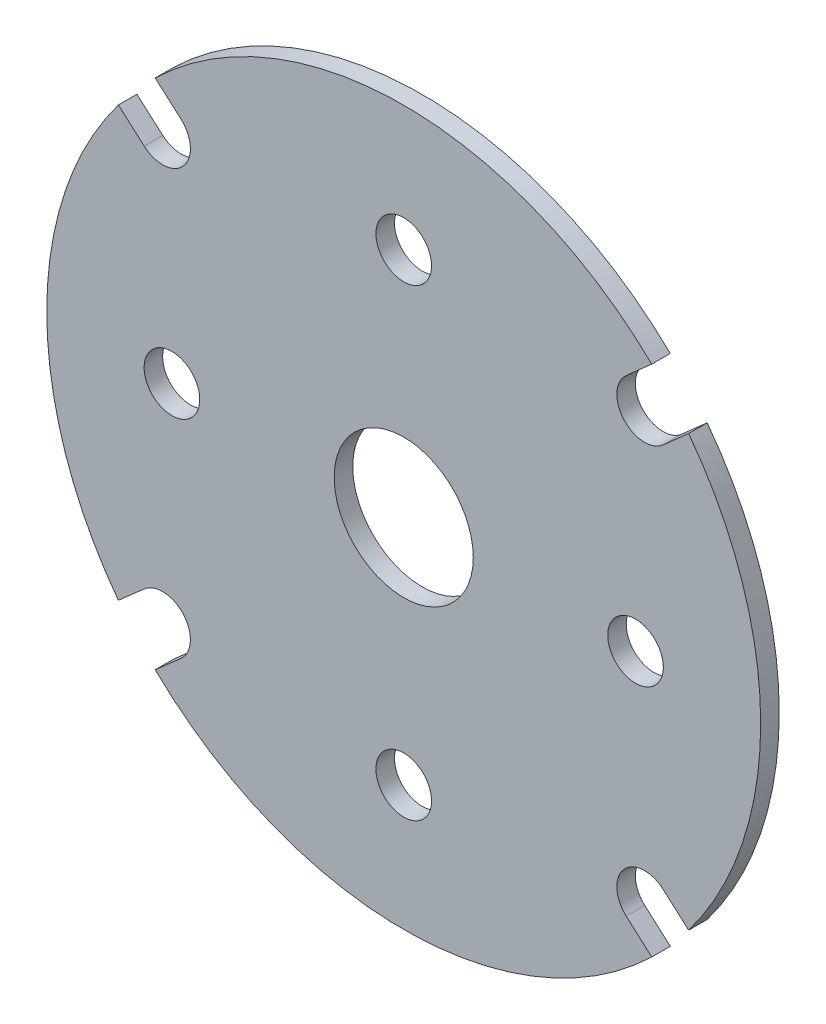
ISO-10303-21;
HEADER;
FILE_DESCRIPTION(('STEP AP214'),'2;1');
FILE_NAME('part.step','',(''),(''),'','','');
FILE_SCHEMA(('AUTOMOTIVE_DESIGN { 1 0 10303 214 1 1 1 1 }'));
ENDSEC;
DATA;
#1=APPLICATION_CONTEXT('core data for automotive mechanical design processes');
#2=APPLICATION_PROTOCOL_DEFINITION('international standard','automotive_design',2000,#1);
#3=PRODUCT_CONTEXT('',#1,'mechanical');
#4=PRODUCT('Part','Part','',(#3));
#5=PRODUCT_RELATED_PRODUCT_CATEGORY('part','',(#4));
#6=PRODUCT_DEFINITION_FORMATION('','',#4);
#7=PRODUCT_DEFINITION_CONTEXT('part definition',#1,'design');
#8=PRODUCT_DEFINITION('design','',#6,#7);
#9=PRODUCT_DEFINITION_SHAPE('','',#8);
#10=(LENGTH_UNIT() NAMED_UNIT(*) SI_UNIT(.MILLI.,.METRE.));
#11=(NAMED_UNIT(*) PLANE_ANGLE_UNIT() SI_UNIT($,.RADIAN.));
#12=(NAMED_UNIT(*) SI_UNIT($,.STERADIAN.) SOLID_ANGLE_UNIT());
#13=UNCERTAINTY_MEASURE_WITH_UNIT(LENGTH_MEASURE(1.E-05),#10,'distance_accuracy_value','');
#14=(GEOMETRIC_REPRESENTATION_CONTEXT(3) GLOBAL_UNCERTAINTY_ASSIGNED_CONTEXT((#13)) GLOBAL_UNIT_ASSIGNED_CONTEXT((#10,
#11,#12)) REPRESENTATION_CONTEXT('',''));
#15=CARTESIAN_POINT('',(0.,0.,0.));
#16=DIRECTION('',(0.,0.,1.));
#17=DIRECTION('',(1.,0.,0.));
#18=AXIS2_PLACEMENT_3D('',#15,#16,#17);
#19=CARTESIAN_POINT('',(0.,0.,2.));
#20=DIRECTION('',(0.,0.,1.));
#21=DIRECTION('',(1.,0.,0.));
#22=AXIS2_PLACEMENT_3D('',#19,#20,#21);
#23=PLANE('',#22);
#24=CARTESIAN_POINT('',(0.,-25.0000000000001,2.));
#25=DIRECTION('',(0.,0.,1.));
#26=DIRECTION('',(1.,0.,0.));
#27=AXIS2_PLACEMENT_3D('',#24,#25,#26);
#28=CIRCLE('',#27,3.00000000000011);
#29=CARTESIAN_POINT('',(3.00000000000011,-25.0000000000001,2.));
#30=VERTEX_POINT('',#29);
#31=EDGE_CURVE('E349',#30,#30,#28,.T.);
#32=ORIENTED_EDGE('',*,*,#31,.F.);
#33=EDGE_LOOP('',(#32));
#34=FACE_BOUND('',#33,.T.);
#35=CARTESIAN_POINT('',(0.,24.9999999999999,2.));
#36=DIRECTION('',(0.,0.,1.));
#37=DIRECTION('',(1.,0.,0.));
#38=AXIS2_PLACEMENT_3D('',#35,#36,#37);
#39=CIRCLE('',#38,3.00000000000011);
#40=CARTESIAN_POINT('',(3.00000000000011,24.9999999999999,2.));
#41=VERTEX_POINT('',#40);
#42=EDGE_CURVE('E361',#41,#41,#39,.T.);
#43=ORIENTED_EDGE('',*,*,#42,.F.);
#44=EDGE_LOOP('',(#43));
#45=FACE_BOUND('',#44,.T.);
#46=CARTESIAN_POINT('',(0.,0.,2.));
#47=DIRECTION('',(0.,0.,1.));
#48=DIRECTION('',(1.,0.,0.));
#49=AXIS2_PLACEMENT_3D('',#46,#47,#48);
#50=CIRCLE('',#49,38.5000000000003);
#51=CARTESIAN_POINT('',(-26.8052389537679,-27.6356502480298,2.));
#52=VERTEX_POINT('',#51);
#53=CARTESIAN_POINT('',(26.7507981884077,-27.6883512741931,2.));
#54=VERTEX_POINT('',#53);
#55=EDGE_CURVE('E210',#52,#54,#50,.T.);
#56=ORIENTED_EDGE('',*,*,#55,.T.);
#57=DIRECTION('',(-0.748753116344693,0.662848980359864,0.));
#58=VECTOR('',#57,1.);
#59=CARTESIAN_POINT('',(26.7507981884077,-27.6883512741931,2.));
#60=LINE('',#59,#58);
#61=CARTESIAN_POINT('',(23.9922151724543,-25.2462593490344,2.));
#62=VERTEX_POINT('',#61);
#63=EDGE_CURVE('E118',#54,#62,#60,.T.);
#64=ORIENTED_EDGE('',*,*,#63,.T.);
#65=CARTESIAN_POINT('',(25.980762113534,-23.0000000000003,2.));
#66=DIRECTION('',(0.,0.,-1.));
#67=DIRECTION('',(1.,0.,0.));
#68=AXIS2_PLACEMENT_3D('',#65,#66,#67);
#69=CIRCLE('',#68,3.00000000000012);
#70=CARTESIAN_POINT('',(27.9693090546136,-20.7537406509661,2.));
#71=VERTEX_POINT('',#70);
#72=EDGE_CURVE('E249',#62,#71,#69,.T.);
#73=ORIENTED_EDGE('',*,*,#72,.T.);
#74=DIRECTION('',(0.748753116344697,-0.662848980359859,0.));
#75=VECTOR('',#74,1.);
#76=CARTESIAN_POINT('',(30.727892070567,-23.1958325761247,2.));
#77=LINE('',#76,#75);
#78=CARTESIAN_POINT('',(30.7278920705669,-23.1958325761246,2.));
#79=VERTEX_POINT('',#78);
#80=EDGE_CURVE('E268',#71,#79,#77,.T.);
#81=ORIENTED_EDGE('',*,*,#80,.T.);
#82=CARTESIAN_POINT('',(0.,0.,2.));
#83=DIRECTION('',(0.,0.,1.));
#84=DIRECTION('',(1.,0.,0.));
#85=AXIS2_PLACEMENT_3D('',#82,#83,#84);
#86=CIRCLE('',#85,38.5000000000002);
#87=CARTESIAN_POINT('',(30.7278920705669,23.1958325761245,2.));
#88=VERTEX_POINT('',#87);
#89=EDGE_CURVE('E265',#79,#88,#86,.T.);
#90=ORIENTED_EDGE('',*,*,#89,.T.);
#91=DIRECTION('',(-0.748753116344741,-0.662848980359809,0.));
#92=VECTOR('',#91,1.);
#93=CARTESIAN_POINT('',(30.7278920705669,23.1958325761245,2.));
#94=LINE('',#93,#92);
#95=CARTESIAN_POINT('',(27.9693090546134,20.7537406509661,2.));
#96=VERTEX_POINT('',#95);
#97=EDGE_CURVE('E267',#88,#96,#94,.T.);
#98=ORIENTED_EDGE('',*,*,#97,.T.);
#99=CARTESIAN_POINT('',(25.9807621135337,23.0000000000004,2.));
#100=DIRECTION('',(0.,0.,-1.));
#101=DIRECTION('',(1.,0.,0.));
#102=AXIS2_PLACEMENT_3D('',#99,#100,#101);
#103=CIRCLE('',#102,3.00000000000015);
#104=CARTESIAN_POINT('',(23.9922151724543,25.2462593490348,2.));
#105=VERTEX_POINT('',#104);
#106=EDGE_CURVE('E270',#96,#105,#103,.T.);
#107=ORIENTED_EDGE('',*,*,#106,.T.);
#108=DIRECTION('',(0.748753116344744,0.662848980359806,0.));
#109=VECTOR('',#108,1.);
#110=CARTESIAN_POINT('',(26.7507981884076,27.688351274193,2.));
#111=LINE('',#110,#109);
#112=CARTESIAN_POINT('',(26.7507981884077,27.688351274193,2.));
#113=VERTEX_POINT('',#112);
#114=EDGE_CURVE('E276',#105,#113,#111,.T.);
#115=ORIENTED_EDGE('',*,*,#114,.T.);
#116=CARTESIAN_POINT('',(0.,0.,2.));
#117=DIRECTION('',(0.,0.,1.));
#118=DIRECTION('',(1.,0.,0.));
#119=AXIS2_PLACEMENT_3D('',#116,#117,#118);
#120=CIRCLE('',#119,38.5000000000003);
#121=CARTESIAN_POINT('',(-26.8052389537679,27.6356502480298,2.));
#122=VERTEX_POINT('',#121);
#123=EDGE_CURVE('E278',#113,#122,#120,.T.);
#124=ORIENTED_EDGE('',*,*,#123,.T.);
#125=DIRECTION('',(0.750056198478624,-0.661374099223574,0.));
#126=VECTOR('',#125,1.);
#127=CARTESIAN_POINT('',(-26.8052389537679,27.6356502480298,2.));
#128=LINE('',#127,#126);
#129=CARTESIAN_POINT('',(-24.0224474767815,25.1818791704065,2.));
#130=VERTEX_POINT('',#129);
#131=EDGE_CURVE('E280',#122,#130,#128,.T.);
#132=ORIENTED_EDGE('',*,*,#131,.T.);
#133=CARTESIAN_POINT('',(-26.0065697744524,22.9317105749705,2.));
#134=DIRECTION('',(0.,0.,-1.));
#135=DIRECTION('',(1.,0.,0.));
#136=AXIS2_PLACEMENT_3D('',#133,#134,#135);
#137=CIRCLE('',#136,3.00000000000024);
#138=CARTESIAN_POINT('',(-27.9906920721234,20.6815419795345,2.));
#139=VERTEX_POINT('',#138);
#140=EDGE_CURVE('E282',#130,#139,#137,.T.);
#141=ORIENTED_EDGE('',*,*,#140,.T.);
#142=DIRECTION('',(-0.75005619847859,0.661374099223613,0.));
#143=VECTOR('',#142,1.);
#144=CARTESIAN_POINT('',(-30.7734835491096,23.1353130571579,2.));
#145=LINE('',#144,#143);
#146=CARTESIAN_POINT('',(-30.7734835491096,23.1353130571579,2.));
#147=VERTEX_POINT('',#146);
#148=EDGE_CURVE('E284',#139,#147,#145,.T.);
#149=ORIENTED_EDGE('',*,*,#148,.T.);
#150=CARTESIAN_POINT('',(0.,0.,2.));
#151=DIRECTION('',(0.,0.,1.));
#152=DIRECTION('',(1.,0.,0.));
#153=AXIS2_PLACEMENT_3D('',#150,#151,#152);
#154=CIRCLE('',#153,38.5000000000003);
#155=CARTESIAN_POINT('',(-30.7734835491096,-23.1353130571579,2.));
#156=VERTEX_POINT('',#155);
#157=EDGE_CURVE('E161',#147,#156,#154,.T.);
#158=ORIENTED_EDGE('',*,*,#157,.T.);
#159=DIRECTION('',(0.750056198478616,0.661374099223583,0.));
#160=VECTOR('',#159,1.);
#161=CARTESIAN_POINT('',(-30.7734835491096,-23.1353130571579,2.));
#162=LINE('',#161,#160);
#163=CARTESIAN_POINT('',(-27.9906920721233,-20.6815419795345,2.));
#164=VERTEX_POINT('',#163);
#165=EDGE_CURVE('E155',#156,#164,#162,.T.);
#166=ORIENTED_EDGE('',*,*,#165,.T.);
#167=CARTESIAN_POINT('',(-26.0065697744524,-22.9317105749705,2.));
#168=DIRECTION('',(0.,0.,-1.));
#169=DIRECTION('',(1.,0.,0.));
#170=AXIS2_PLACEMENT_3D('',#167,#168,#169);
#171=CIRCLE('',#170,3.00000000000018);
#172=CARTESIAN_POINT('',(-24.0224474767815,-25.1818791704065,2.));
#173=VERTEX_POINT('',#172);
#174=EDGE_CURVE('E159',#164,#173,#171,.T.);
#175=ORIENTED_EDGE('',*,*,#174,.T.);
#176=DIRECTION('',(-0.750056198478624,-0.661374099223574,0.));
#177=VECTOR('',#176,1.);
#178=CARTESIAN_POINT('',(-26.8052389537679,-27.6356502480298,2.));
#179=LINE('',#178,#177);
#180=EDGE_CURVE('E51',#173,#52,#179,.T.);
#181=ORIENTED_EDGE('',*,*,#180,.T.);
#182=EDGE_LOOP('',(#56,#64,#73,#81,#90,#98,#107,#115,#124,#132,#141,#149,#158,#166,#175,#181));
#183=FACE_BOUND('',#182,.T.);
#184=CARTESIAN_POINT('',(0.,0.,2.));
#185=DIRECTION('',(0.,0.,1.));
#186=DIRECTION('',(1.,0.,0.));
#187=AXIS2_PLACEMENT_3D('',#184,#185,#186);
#188=CIRCLE('',#187,7.49999999999984);
#189=CARTESIAN_POINT('',(7.49999999999984,0.,2.));
#190=VERTEX_POINT('',#189);
#191=EDGE_CURVE('E183',#190,#190,#188,.T.);
#192=ORIENTED_EDGE('',*,*,#191,.F.);
#193=EDGE_LOOP('',(#192));
#194=FACE_BOUND('',#193,.T.);
#195=CARTESIAN_POINT('',(24.9999999999999,0.,2.));
#196=DIRECTION('',(0.,0.,1.));
#197=DIRECTION('',(1.,0.,0.));
#198=AXIS2_PLACEMENT_3D('',#195,#196,#197);
#199=CIRCLE('',#198,3.00000000000011);
#200=CARTESIAN_POINT('',(28.,0.,2.));
#201=VERTEX_POINT('',#200);
#202=EDGE_CURVE('E355',#201,#201,#199,.T.);
#203=ORIENTED_EDGE('',*,*,#202,.F.);
#204=EDGE_LOOP('',(#203));
#205=FACE_BOUND('',#204,.T.);
#206=CARTESIAN_POINT('',(-24.9999999999999,0.,2.));
#207=DIRECTION('',(0.,0.,1.));
#208=DIRECTION('',(1.,0.,0.));
#209=AXIS2_PLACEMENT_3D('',#206,#207,#208);
#210=CIRCLE('',#209,3.00000000000011);
#211=CARTESIAN_POINT('',(-21.9999999999998,0.,2.));
#212=VERTEX_POINT('',#211);
#213=EDGE_CURVE('E340',#212,#212,#210,.T.);
#214=ORIENTED_EDGE('',*,*,#213,.F.);
#215=EDGE_LOOP('',(#214));
#216=FACE_BOUND('',#215,.T.);
#217=ADVANCED_FACE('F34',(#34,#45,#183,#194,#205,#216),#23,.T.);
#218=CARTESIAN_POINT('',(0.,0.,0.));
#219=DIRECTION('',(0.,0.,1.));
#220=DIRECTION('',(1.,0.,0.));
#221=AXIS2_PLACEMENT_3D('',#218,#219,#220);
#222=PLANE('',#221);
#223=CARTESIAN_POINT('',(0.,-25.0000000000001,0.));
#224=DIRECTION('',(0.,0.,1.));
#225=DIRECTION('',(1.,0.,0.));
#226=AXIS2_PLACEMENT_3D('',#223,#224,#225);
#227=CIRCLE('',#226,3.00000000000011);
#228=CARTESIAN_POINT('',(3.00000000000011,-25.0000000000001,0.));
#229=VERTEX_POINT('',#228);
#230=EDGE_CURVE('E346',#229,#229,#227,.T.);
#231=ORIENTED_EDGE('',*,*,#230,.T.);
#232=EDGE_LOOP('',(#231));
#233=FACE_BOUND('',#232,.T.);
#234=CARTESIAN_POINT('',(0.,24.9999999999999,0.));
#235=DIRECTION('',(0.,0.,1.));
#236=DIRECTION('',(1.,0.,0.));
#237=AXIS2_PLACEMENT_3D('',#234,#235,#236);
#238=CIRCLE('',#237,3.00000000000011);
#239=CARTESIAN_POINT('',(3.00000000000011,24.9999999999999,0.));
#240=VERTEX_POINT('',#239);
#241=EDGE_CURVE('E358',#240,#240,#238,.T.);
#242=ORIENTED_EDGE('',*,*,#241,.T.);
#243=EDGE_LOOP('',(#242));
#244=FACE_BOUND('',#243,.T.);
#245=CARTESIAN_POINT('',(0.,0.,0.));
#246=DIRECTION('',(0.,0.,1.));
#247=DIRECTION('',(1.,0.,0.));
#248=AXIS2_PLACEMENT_3D('',#245,#246,#247);
#249=CIRCLE('',#248,38.5000000000003);
#250=CARTESIAN_POINT('',(-26.8052389537679,-27.6356502480298,0.));
#251=VERTEX_POINT('',#250);
#252=CARTESIAN_POINT('',(26.7507981884077,-27.6883512741931,0.));
#253=VERTEX_POINT('',#252);
#254=EDGE_CURVE('E179',#251,#253,#249,.T.);
#255=ORIENTED_EDGE('',*,*,#254,.F.);
#256=DIRECTION('',(-0.750056198478624,-0.661374099223574,0.));
#257=VECTOR('',#256,1.);
#258=CARTESIAN_POINT('',(-26.8052389537679,-27.6356502480298,0.));
#259=LINE('',#258,#257);
#260=CARTESIAN_POINT('',(-24.0224474767815,-25.1818791704065,0.));
#261=VERTEX_POINT('',#260);
#262=EDGE_CURVE('E110',#261,#251,#259,.T.);
#263=ORIENTED_EDGE('',*,*,#262,.F.);
#264=CARTESIAN_POINT('',(-26.0065697744524,-22.9317105749705,0.));
#265=DIRECTION('',(0.,0.,-1.));
#266=DIRECTION('',(1.,0.,0.));
#267=AXIS2_PLACEMENT_3D('',#264,#265,#266);
#268=CIRCLE('',#267,3.00000000000018);
#269=CARTESIAN_POINT('',(-27.9906920721233,-20.6815419795345,0.));
#270=VERTEX_POINT('',#269);
#271=EDGE_CURVE('E104',#270,#261,#268,.T.);
#272=ORIENTED_EDGE('',*,*,#271,.F.);
#273=DIRECTION('',(0.750056198478616,0.661374099223583,0.));
#274=VECTOR('',#273,1.);
#275=CARTESIAN_POINT('',(-30.7734835491096,-23.1353130571579,0.));
#276=LINE('',#275,#274);
#277=CARTESIAN_POINT('',(-30.7734835491096,-23.1353130571579,0.));
#278=VERTEX_POINT('',#277);
#279=EDGE_CURVE('E169',#278,#270,#276,.T.);
#280=ORIENTED_EDGE('',*,*,#279,.F.);
#281=CARTESIAN_POINT('',(0.,0.,0.));
#282=DIRECTION('',(0.,0.,1.));
#283=DIRECTION('',(1.,0.,0.));
#284=AXIS2_PLACEMENT_3D('',#281,#282,#283);
#285=CIRCLE('',#284,38.5000000000003);
#286=CARTESIAN_POINT('',(-30.7734835491096,23.1353130571579,0.));
#287=VERTEX_POINT('',#286);
#288=EDGE_CURVE('E205',#287,#278,#285,.T.);
#289=ORIENTED_EDGE('',*,*,#288,.F.);
#290=DIRECTION('',(-0.75005619847859,0.661374099223613,0.));
#291=VECTOR('',#290,1.);
#292=CARTESIAN_POINT('',(-30.7734835491096,23.1353130571579,0.));
#293=LINE('',#292,#291);
#294=CARTESIAN_POINT('',(-27.9906920721234,20.6815419795345,0.));
#295=VERTEX_POINT('',#294);
#296=EDGE_CURVE('E203',#295,#287,#293,.T.);
#297=ORIENTED_EDGE('',*,*,#296,.F.);
#298=CARTESIAN_POINT('',(-26.0065697744524,22.9317105749705,0.));
#299=DIRECTION('',(0.,0.,-1.));
#300=DIRECTION('',(1.,0.,0.));
#301=AXIS2_PLACEMENT_3D('',#298,#299,#300);
#302=CIRCLE('',#301,3.00000000000024);
#303=CARTESIAN_POINT('',(-24.0224474767815,25.1818791704065,0.));
#304=VERTEX_POINT('',#303);
#305=EDGE_CURVE('E201',#304,#295,#302,.T.);
#306=ORIENTED_EDGE('',*,*,#305,.F.);
#307=DIRECTION('',(0.750056198478624,-0.661374099223574,0.));
#308=VECTOR('',#307,1.);
#309=CARTESIAN_POINT('',(-26.8052389537679,27.6356502480298,0.));
#310=LINE('',#309,#308);
#311=CARTESIAN_POINT('',(-26.8052389537679,27.6356502480298,0.));
#312=VERTEX_POINT('',#311);
#313=EDGE_CURVE('E199',#312,#304,#310,.T.);
#314=ORIENTED_EDGE('',*,*,#313,.F.);
#315=CARTESIAN_POINT('',(0.,0.,0.));
#316=DIRECTION('',(0.,0.,1.));
#317=DIRECTION('',(1.,0.,0.));
#318=AXIS2_PLACEMENT_3D('',#315,#316,#317);
#319=CIRCLE('',#318,38.5000000000003);
#320=CARTESIAN_POINT('',(26.7507981884077,27.688351274193,0.));
#321=VERTEX_POINT('',#320);
#322=EDGE_CURVE('E197',#321,#312,#319,.T.);
#323=ORIENTED_EDGE('',*,*,#322,.F.);
#324=DIRECTION('',(0.748753116344744,0.662848980359806,0.));
#325=VECTOR('',#324,1.);
#326=CARTESIAN_POINT('',(26.7507981884076,27.688351274193,0.));
#327=LINE('',#326,#325);
#328=CARTESIAN_POINT('',(23.9922151724543,25.2462593490348,0.));
#329=VERTEX_POINT('',#328);
#330=EDGE_CURVE('E195',#329,#321,#327,.T.);
#331=ORIENTED_EDGE('',*,*,#330,.F.);
#332=CARTESIAN_POINT('',(25.9807621135337,23.0000000000004,0.));
#333=DIRECTION('',(0.,0.,-1.));
#334=DIRECTION('',(1.,0.,0.));
#335=AXIS2_PLACEMENT_3D('',#332,#333,#334);
#336=CIRCLE('',#335,3.00000000000015);
#337=CARTESIAN_POINT('',(27.9693090546134,20.7537406509661,0.));
#338=VERTEX_POINT('',#337);
#339=EDGE_CURVE('E193',#338,#329,#336,.T.);
#340=ORIENTED_EDGE('',*,*,#339,.F.);
#341=DIRECTION('',(-0.748753116344741,-0.662848980359809,0.));
#342=VECTOR('',#341,1.);
#343=CARTESIAN_POINT('',(30.7278920705669,23.1958325761245,0.));
#344=LINE('',#343,#342);
#345=CARTESIAN_POINT('',(30.7278920705669,23.1958325761245,0.));
#346=VERTEX_POINT('',#345);
#347=EDGE_CURVE('E191',#346,#338,#344,.T.);
#348=ORIENTED_EDGE('',*,*,#347,.F.);
#349=CARTESIAN_POINT('',(0.,0.,0.));
#350=DIRECTION('',(0.,0.,1.));
#351=DIRECTION('',(1.,0.,0.));
#352=AXIS2_PLACEMENT_3D('',#349,#350,#351);
#353=CIRCLE('',#352,38.5000000000002);
#354=CARTESIAN_POINT('',(30.7278920705669,-23.1958325761246,0.));
#355=VERTEX_POINT('',#354);
#356=EDGE_CURVE('E189',#355,#346,#353,.T.);
#357=ORIENTED_EDGE('',*,*,#356,.F.);
#358=DIRECTION('',(0.748753116344697,-0.662848980359859,0.));
#359=VECTOR('',#358,1.);
#360=CARTESIAN_POINT('',(30.727892070567,-23.1958325761247,0.));
#361=LINE('',#360,#359);
#362=CARTESIAN_POINT('',(27.9693090546136,-20.7537406509661,0.));
#363=VERTEX_POINT('',#362);
#364=EDGE_CURVE('E187',#363,#355,#361,.T.);
#365=ORIENTED_EDGE('',*,*,#364,.F.);
#366=CARTESIAN_POINT('',(25.980762113534,-23.0000000000003,0.));
#367=DIRECTION('',(0.,0.,-1.));
#368=DIRECTION('',(1.,0.,0.));
#369=AXIS2_PLACEMENT_3D('',#366,#367,#368);
#370=CIRCLE('',#369,3.00000000000012);
#371=CARTESIAN_POINT('',(23.9922151724543,-25.2462593490344,0.));
#372=VERTEX_POINT('',#371);
#373=EDGE_CURVE('E185',#372,#363,#370,.T.);
#374=ORIENTED_EDGE('',*,*,#373,.F.);
#375=DIRECTION('',(-0.748753116344693,0.662848980359864,0.));
#376=VECTOR('',#375,1.);
#377=CARTESIAN_POINT('',(26.7507981884077,-27.6883512741931,0.));
#378=LINE('',#377,#376);
#379=EDGE_CURVE('E182',#253,#372,#378,.T.);
#380=ORIENTED_EDGE('',*,*,#379,.F.);
#381=EDGE_LOOP('',(#255,#263,#272,#280,#289,#297,#306,#314,#323,#331,#340,#348,#357,#365,#374,#380));
#382=FACE_BOUND('',#381,.T.);
#383=CARTESIAN_POINT('',(0.,0.,0.));
#384=DIRECTION('',(0.,0.,1.));
#385=DIRECTION('',(1.,0.,0.));
#386=AXIS2_PLACEMENT_3D('',#383,#384,#385);
#387=CIRCLE('',#386,7.49999999999984);
#388=CARTESIAN_POINT('',(7.49999999999984,0.,0.));
#389=VERTEX_POINT('',#388);
#390=EDGE_CURVE('E364',#389,#389,#387,.T.);
#391=ORIENTED_EDGE('',*,*,#390,.T.);
#392=EDGE_LOOP('',(#391));
#393=FACE_BOUND('',#392,.T.);
#394=CARTESIAN_POINT('',(24.9999999999999,0.,0.));
#395=DIRECTION('',(0.,0.,1.));
#396=DIRECTION('',(1.,0.,0.));
#397=AXIS2_PLACEMENT_3D('',#394,#395,#396);
#398=CIRCLE('',#397,3.00000000000011);
#399=CARTESIAN_POINT('',(28.,0.,0.));
#400=VERTEX_POINT('',#399);
#401=EDGE_CURVE('E352',#400,#400,#398,.T.);
#402=ORIENTED_EDGE('',*,*,#401,.T.);
#403=EDGE_LOOP('',(#402));
#404=FACE_BOUND('',#403,.T.);
#405=CARTESIAN_POINT('',(-24.9999999999999,0.,0.));
#406=DIRECTION('',(0.,0.,1.));
#407=DIRECTION('',(1.,0.,0.));
#408=AXIS2_PLACEMENT_3D('',#405,#406,#407);
#409=CIRCLE('',#408,3.00000000000011);
#410=CARTESIAN_POINT('',(-21.9999999999998,0.,0.));
#411=VERTEX_POINT('',#410);
#412=EDGE_CURVE('E343',#411,#411,#409,.T.);
#413=ORIENTED_EDGE('',*,*,#412,.T.);
#414=EDGE_LOOP('',(#413));
#415=FACE_BOUND('',#414,.T.);
#416=ADVANCED_FACE('F253',(#233,#244,#382,#393,#404,#415),#222,.F.);
#417=CARTESIAN_POINT('',(0.,0.,2.));
#418=DIRECTION('',(0.,0.,-1.));
#419=DIRECTION('',(-1.,0.,0.));
#420=AXIS2_PLACEMENT_3D('',#417,#418,#419);
#421=CYLINDRICAL_SURFACE('',#420,38.5000000000003);
#422=ORIENTED_EDGE('',*,*,#254,.T.);
#423=DIRECTION('',(0.,0.,-1.));
#424=VECTOR('',#423,1.);
#425=CARTESIAN_POINT('',(26.7507981884077,-27.6883512741931,2.));
#426=LINE('',#425,#424);
#427=EDGE_CURVE('E11',#54,#253,#426,.T.);
#428=ORIENTED_EDGE('',*,*,#427,.F.);
#429=ORIENTED_EDGE('',*,*,#55,.F.);
#430=DIRECTION('',(0.,0.,-1.));
#431=VECTOR('',#430,1.);
#432=CARTESIAN_POINT('',(-26.8052389537679,-27.6356502480298,2.));
#433=LINE('',#432,#431);
#434=EDGE_CURVE('E175',#52,#251,#433,.T.);
#435=ORIENTED_EDGE('',*,*,#434,.T.);
#436=EDGE_LOOP('',(#422,#428,#429,#435));
#437=FACE_BOUND('',#436,.T.);
#438=ADVANCED_FACE('F36',(#437),#421,.T.);
#439=CARTESIAN_POINT('',(26.7507981884077,-27.6883512741931,2.));
#440=DIRECTION('',(-0.662848980359864,-0.748753116344693,0.));
#441=DIRECTION('',(0.748753116344693,-0.662848980359864,0.));
#442=AXIS2_PLACEMENT_3D('',#439,#440,#441);
#443=PLANE('',#442);
#444=ORIENTED_EDGE('',*,*,#379,.T.);
#445=DIRECTION('',(0.,0.,-1.));
#446=VECTOR('',#445,1.);
#447=CARTESIAN_POINT('',(23.9922151724543,-25.2462593490344,2.));
#448=LINE('',#447,#446);
#449=EDGE_CURVE('E43',#62,#372,#448,.T.);
#450=ORIENTED_EDGE('',*,*,#449,.F.);
#451=ORIENTED_EDGE('',*,*,#63,.F.);
#452=ORIENTED_EDGE('',*,*,#427,.T.);
#453=EDGE_LOOP('',(#444,#450,#451,#452));
#454=FACE_BOUND('',#453,.T.);
#455=ADVANCED_FACE('F522',(#454),#443,.F.);
#456=CARTESIAN_POINT('',(25.980762113534,-23.0000000000003,2.));
#457=DIRECTION('',(0.,0.,-1.));
#458=DIRECTION('',(-1.,0.,0.));
#459=AXIS2_PLACEMENT_3D('',#456,#457,#458);
#460=CYLINDRICAL_SURFACE('',#459,3.00000000000012);
#461=ORIENTED_EDGE('',*,*,#373,.T.);
#462=DIRECTION('',(0.,0.,-1.));
#463=VECTOR('',#462,1.);
#464=CARTESIAN_POINT('',(27.9693090546136,-20.7537406509661,2.));
#465=LINE('',#464,#463);
#466=EDGE_CURVE('E241',#71,#363,#465,.T.);
#467=ORIENTED_EDGE('',*,*,#466,.F.);
#468=ORIENTED_EDGE('',*,*,#72,.F.);
#469=ORIENTED_EDGE('',*,*,#449,.T.);
#470=EDGE_LOOP('',(#461,#467,#468,#469));
#471=FACE_BOUND('',#470,.T.);
#472=ADVANCED_FACE('F247',(#471),#460,.F.);
#473=CARTESIAN_POINT('',(30.727892070567,-23.1958325761247,2.));
#474=DIRECTION('',(0.662848980359859,0.748753116344697,0.));
#475=DIRECTION('',(-0.748753116344697,0.662848980359859,0.));
#476=AXIS2_PLACEMENT_3D('',#473,#474,#475);
#477=PLANE('',#476);
#478=ORIENTED_EDGE('',*,*,#364,.T.);
#479=DIRECTION('',(0.,0.,-1.));
#480=VECTOR('',#479,1.);
#481=CARTESIAN_POINT('',(30.7278920705669,-23.1958325761246,2.));
#482=LINE('',#481,#480);
#483=EDGE_CURVE('E238',#79,#355,#482,.T.);
#484=ORIENTED_EDGE('',*,*,#483,.F.);
#485=ORIENTED_EDGE('',*,*,#80,.F.);
#486=ORIENTED_EDGE('',*,*,#466,.T.);
#487=EDGE_LOOP('',(#478,#484,#485,#486));
#488=FACE_BOUND('',#487,.T.);
#489=ADVANCED_FACE('F259',(#488),#477,.F.);
#490=CARTESIAN_POINT('',(0.,0.,2.));
#491=DIRECTION('',(0.,0.,-1.));
#492=DIRECTION('',(-1.,0.,0.));
#493=AXIS2_PLACEMENT_3D('',#490,#491,#492);
#494=CYLINDRICAL_SURFACE('',#493,38.5000000000002);
#495=ORIENTED_EDGE('',*,*,#356,.T.);
#496=DIRECTION('',(0.,0.,-1.));
#497=VECTOR('',#496,1.);
#498=CARTESIAN_POINT('',(30.7278920705669,23.1958325761245,2.));
#499=LINE('',#498,#497);
#500=EDGE_CURVE('E235',#88,#346,#499,.T.);
#501=ORIENTED_EDGE('',*,*,#500,.F.);
#502=ORIENTED_EDGE('',*,*,#89,.F.);
#503=ORIENTED_EDGE('',*,*,#483,.T.);
#504=EDGE_LOOP('',(#495,#501,#502,#503));
#505=FACE_BOUND('',#504,.T.);
#506=ADVANCED_FACE('F263',(#505),#494,.T.);
#507=CARTESIAN_POINT('',(30.7278920705669,23.1958325761245,2.));
#508=DIRECTION('',(0.662848980359809,-0.748753116344741,0.));
#509=DIRECTION('',(0.748753116344741,0.662848980359809,0.));
#510=AXIS2_PLACEMENT_3D('',#507,#508,#509);
#511=PLANE('',#510);
#512=ORIENTED_EDGE('',*,*,#347,.T.);
#513=DIRECTION('',(0.,0.,-1.));
#514=VECTOR('',#513,1.);
#515=CARTESIAN_POINT('',(27.9693090546134,20.7537406509661,2.));
#516=LINE('',#515,#514);
#517=EDGE_CURVE('E232',#96,#338,#516,.T.);
#518=ORIENTED_EDGE('',*,*,#517,.F.);
#519=ORIENTED_EDGE('',*,*,#97,.F.);
#520=ORIENTED_EDGE('',*,*,#500,.T.);
#521=EDGE_LOOP('',(#512,#518,#519,#520));
#522=FACE_BOUND('',#521,.T.);
#523=ADVANCED_FACE('F487',(#522),#511,.F.);
#524=CARTESIAN_POINT('',(25.9807621135337,23.0000000000004,2.));
#525=DIRECTION('',(0.,0.,-1.));
#526=DIRECTION('',(-1.,0.,0.));
#527=AXIS2_PLACEMENT_3D('',#524,#525,#526);
#528=CYLINDRICAL_SURFACE('',#527,3.00000000000015);
#529=ORIENTED_EDGE('',*,*,#339,.T.);
#530=DIRECTION('',(0.,0.,-1.));
#531=VECTOR('',#530,1.);
#532=CARTESIAN_POINT('',(23.9922151724543,25.2462593490348,2.));
#533=LINE('',#532,#531);
#534=EDGE_CURVE('E229',#105,#329,#533,.T.);
#535=ORIENTED_EDGE('',*,*,#534,.F.);
#536=ORIENTED_EDGE('',*,*,#106,.F.);
#537=ORIENTED_EDGE('',*,*,#517,.T.);
#538=EDGE_LOOP('',(#529,#535,#536,#537));
#539=FACE_BOUND('',#538,.T.);
#540=ADVANCED_FACE('F477',(#539),#528,.F.);
#541=CARTESIAN_POINT('',(26.7507981884076,27.688351274193,2.));
#542=DIRECTION('',(-0.662848980359806,0.748753116344744,0.));
#543=DIRECTION('',(-0.748753116344744,-0.662848980359806,0.));
#544=AXIS2_PLACEMENT_3D('',#541,#542,#543);
#545=PLANE('',#544);
#546=ORIENTED_EDGE('',*,*,#330,.T.);
#547=DIRECTION('',(0.,0.,-1.));
#548=VECTOR('',#547,1.);
#549=CARTESIAN_POINT('',(26.7507981884077,27.688351274193,2.));
#550=LINE('',#549,#548);
#551=EDGE_CURVE('E226',#113,#321,#550,.T.);
#552=ORIENTED_EDGE('',*,*,#551,.F.);
#553=ORIENTED_EDGE('',*,*,#114,.F.);
#554=ORIENTED_EDGE('',*,*,#534,.T.);
#555=EDGE_LOOP('',(#546,#552,#553,#554));
#556=FACE_BOUND('',#555,.T.);
#557=ADVANCED_FACE('F467',(#556),#545,.F.);
#558=CARTESIAN_POINT('',(0.,0.,2.));
#559=DIRECTION('',(0.,0.,-1.));
#560=DIRECTION('',(-1.,0.,0.));
#561=AXIS2_PLACEMENT_3D('',#558,#559,#560);
#562=CYLINDRICAL_SURFACE('',#561,38.5000000000003);
#563=ORIENTED_EDGE('',*,*,#322,.T.);
#564=DIRECTION('',(0.,0.,-1.));
#565=VECTOR('',#564,1.);
#566=CARTESIAN_POINT('',(-26.8052389537679,27.6356502480298,2.));
#567=LINE('',#566,#565);
#568=EDGE_CURVE('E223',#122,#312,#567,.T.);
#569=ORIENTED_EDGE('',*,*,#568,.F.);
#570=ORIENTED_EDGE('',*,*,#123,.F.);
#571=ORIENTED_EDGE('',*,*,#551,.T.);
#572=EDGE_LOOP('',(#563,#569,#570,#571));
#573=FACE_BOUND('',#572,.T.);
#574=ADVANCED_FACE('F457',(#573),#562,.T.);
#575=CARTESIAN_POINT('',(-26.8052389537679,27.6356502480298,2.));
#576=DIRECTION('',(0.661374099223574,0.750056198478625,0.));
#577=DIRECTION('',(-0.750056198478624,0.661374099223574,0.));
#578=AXIS2_PLACEMENT_3D('',#575,#576,#577);
#579=PLANE('',#578);
#580=ORIENTED_EDGE('',*,*,#313,.T.);
#581=DIRECTION('',(0.,0.,-1.));
#582=VECTOR('',#581,1.);
#583=CARTESIAN_POINT('',(-24.0224474767815,25.1818791704065,2.));
#584=LINE('',#583,#582);
#585=EDGE_CURVE('E220',#130,#304,#584,.T.);
#586=ORIENTED_EDGE('',*,*,#585,.F.);
#587=ORIENTED_EDGE('',*,*,#131,.F.);
#588=ORIENTED_EDGE('',*,*,#568,.T.);
#589=EDGE_LOOP('',(#580,#586,#587,#588));
#590=FACE_BOUND('',#589,.T.);
#591=ADVANCED_FACE('F447',(#590),#579,.F.);
#592=CARTESIAN_POINT('',(-26.0065697744524,22.9317105749705,2.));
#593=DIRECTION('',(0.,0.,-1.));
#594=DIRECTION('',(-1.,0.,0.));
#595=AXIS2_PLACEMENT_3D('',#592,#593,#594);
#596=CYLINDRICAL_SURFACE('',#595,3.00000000000024);
#597=ORIENTED_EDGE('',*,*,#305,.T.);
#598=DIRECTION('',(0.,0.,-1.));
#599=VECTOR('',#598,1.);
#600=CARTESIAN_POINT('',(-27.9906920721234,20.6815419795345,2.));
#601=LINE('',#600,#599);
#602=EDGE_CURVE('E217',#139,#295,#601,.T.);
#603=ORIENTED_EDGE('',*,*,#602,.F.);
#604=ORIENTED_EDGE('',*,*,#140,.F.);
#605=ORIENTED_EDGE('',*,*,#585,.T.);
#606=EDGE_LOOP('',(#597,#603,#604,#605));
#607=FACE_BOUND('',#606,.T.);
#608=ADVANCED_FACE('F438',(#607),#596,.F.);
#609=CARTESIAN_POINT('',(-30.7734835491096,23.1353130571579,2.));
#610=DIRECTION('',(-0.661374099223613,-0.75005619847859,0.));
#611=DIRECTION('',(0.750056198478591,-0.661374099223613,0.));
#612=AXIS2_PLACEMENT_3D('',#609,#610,#611);
#613=PLANE('',#612);
#614=ORIENTED_EDGE('',*,*,#296,.T.);
#615=DIRECTION('',(0.,0.,-1.));
#616=VECTOR('',#615,1.);
#617=CARTESIAN_POINT('',(-30.7734835491096,23.1353130571579,2.));
#618=LINE('',#617,#616);
#619=EDGE_CURVE('E214',#147,#287,#618,.T.);
#620=ORIENTED_EDGE('',*,*,#619,.F.);
#621=ORIENTED_EDGE('',*,*,#148,.F.);
#622=ORIENTED_EDGE('',*,*,#602,.T.);
#623=EDGE_LOOP('',(#614,#620,#621,#622));
#624=FACE_BOUND('',#623,.T.);
#625=ADVANCED_FACE('F290',(#624),#613,.F.);
#626=CARTESIAN_POINT('',(0.,0.,2.));
#627=DIRECTION('',(0.,0.,-1.));
#628=DIRECTION('',(-1.,0.,0.));
#629=AXIS2_PLACEMENT_3D('',#626,#627,#628);
#630=CYLINDRICAL_SURFACE('',#629,38.5000000000003);
#631=ORIENTED_EDGE('',*,*,#288,.T.);
#632=DIRECTION('',(0.,0.,-1.));
#633=VECTOR('',#632,1.);
#634=CARTESIAN_POINT('',(-30.7734835491096,-23.1353130571579,2.));
#635=LINE('',#634,#633);
#636=EDGE_CURVE('E170',#156,#278,#635,.T.);
#637=ORIENTED_EDGE('',*,*,#636,.F.);
#638=ORIENTED_EDGE('',*,*,#157,.F.);
#639=ORIENTED_EDGE('',*,*,#619,.T.);
#640=EDGE_LOOP('',(#631,#637,#638,#639));
#641=FACE_BOUND('',#640,.T.);
#642=ADVANCED_FACE('F294',(#641),#630,.T.);
#643=CARTESIAN_POINT('',(-30.7734835491096,-23.1353130571579,2.));
#644=DIRECTION('',(-0.661374099223583,0.750056198478616,0.));
#645=DIRECTION('',(-0.750056198478616,-0.661374099223584,0.));
#646=AXIS2_PLACEMENT_3D('',#643,#644,#645);
#647=PLANE('',#646);
#648=ORIENTED_EDGE('',*,*,#279,.T.);
#649=DIRECTION('',(0.,0.,-1.));
#650=VECTOR('',#649,1.);
#651=CARTESIAN_POINT('',(-27.9906920721233,-20.6815419795345,2.));
#652=LINE('',#651,#650);
#653=EDGE_CURVE('E166',#164,#270,#652,.T.);
#654=ORIENTED_EDGE('',*,*,#653,.F.);
#655=ORIENTED_EDGE('',*,*,#165,.F.);
#656=ORIENTED_EDGE('',*,*,#636,.T.);
#657=EDGE_LOOP('',(#648,#654,#655,#656));
#658=FACE_BOUND('',#657,.T.);
#659=ADVANCED_FACE('F167',(#658),#647,.F.);
#660=CARTESIAN_POINT('',(-26.0065697744524,-22.9317105749705,2.));
#661=DIRECTION('',(0.,0.,-1.));
#662=DIRECTION('',(-1.,0.,0.));
#663=AXIS2_PLACEMENT_3D('',#660,#661,#662);
#664=CYLINDRICAL_SURFACE('',#663,3.00000000000018);
#665=ORIENTED_EDGE('',*,*,#271,.T.);
#666=DIRECTION('',(0.,0.,-1.));
#667=VECTOR('',#666,1.);
#668=CARTESIAN_POINT('',(-24.0224474767815,-25.1818791704065,2.));
#669=LINE('',#668,#667);
#670=EDGE_CURVE('E171',#173,#261,#669,.T.);
#671=ORIENTED_EDGE('',*,*,#670,.F.);
#672=ORIENTED_EDGE('',*,*,#174,.F.);
#673=ORIENTED_EDGE('',*,*,#653,.T.);
#674=EDGE_LOOP('',(#665,#671,#672,#673));
#675=FACE_BOUND('',#674,.T.);
#676=ADVANCED_FACE('F173',(#675),#664,.F.);
#677=CARTESIAN_POINT('',(-26.8052389537679,-27.6356502480298,2.));
#678=DIRECTION('',(0.661374099223574,-0.750056198478625,0.));
#679=DIRECTION('',(0.750056198478624,0.661374099223574,0.));
#680=AXIS2_PLACEMENT_3D('',#677,#678,#679);
#681=PLANE('',#680);
#682=ORIENTED_EDGE('',*,*,#262,.T.);
#683=ORIENTED_EDGE('',*,*,#434,.F.);
#684=ORIENTED_EDGE('',*,*,#180,.F.);
#685=ORIENTED_EDGE('',*,*,#670,.T.);
#686=EDGE_LOOP('',(#682,#683,#684,#685));
#687=FACE_BOUND('',#686,.T.);
#688=ADVANCED_FACE('F298',(#687),#681,.F.);
#689=CARTESIAN_POINT('',(0.,0.,2.));
#690=DIRECTION('',(0.,0.,-1.));
#691=DIRECTION('',(-1.,0.,0.));
#692=AXIS2_PLACEMENT_3D('',#689,#690,#691);
#693=CYLINDRICAL_SURFACE('',#692,7.49999999999984);
#694=ORIENTED_EDGE('',*,*,#191,.T.);
#695=EDGE_LOOP('',(#694));
#696=FACE_BOUND('',#695,.T.);
#697=ORIENTED_EDGE('',*,*,#390,.F.);
#698=EDGE_LOOP('',(#697));
#699=FACE_BOUND('',#698,.T.);
#700=ADVANCED_FACE('F300',(#696,#699),#693,.F.);
#701=CARTESIAN_POINT('',(0.,24.9999999999999,2.));
#702=DIRECTION('',(0.,0.,-1.));
#703=DIRECTION('',(-1.,0.,0.));
#704=AXIS2_PLACEMENT_3D('',#701,#702,#703);
#705=CYLINDRICAL_SURFACE('',#704,3.00000000000011);
#706=ORIENTED_EDGE('',*,*,#42,.T.);
#707=EDGE_LOOP('',(#706));
#708=FACE_BOUND('',#707,.T.);
#709=ORIENTED_EDGE('',*,*,#241,.F.);
#710=EDGE_LOOP('',(#709));
#711=FACE_BOUND('',#710,.T.);
#712=ADVANCED_FACE('F306',(#708,#711),#705,.F.);
#713=CARTESIAN_POINT('',(24.9999999999999,0.,2.));
#714=DIRECTION('',(0.,0.,-1.));
#715=DIRECTION('',(-1.,0.,0.));
#716=AXIS2_PLACEMENT_3D('',#713,#714,#715);
#717=CYLINDRICAL_SURFACE('',#716,3.00000000000011);
#718=ORIENTED_EDGE('',*,*,#202,.T.);
#719=EDGE_LOOP('',(#718));
#720=FACE_BOUND('',#719,.T.);
#721=ORIENTED_EDGE('',*,*,#401,.F.);
#722=EDGE_LOOP('',(#721));
#723=FACE_BOUND('',#722,.T.);
#724=ADVANCED_FACE('F323',(#720,#723),#717,.F.);
#725=CARTESIAN_POINT('',(0.,-25.0000000000001,2.));
#726=DIRECTION('',(0.,0.,-1.));
#727=DIRECTION('',(-1.,0.,0.));
#728=AXIS2_PLACEMENT_3D('',#725,#726,#727);
#729=CYLINDRICAL_SURFACE('',#728,3.00000000000011);
#730=ORIENTED_EDGE('',*,*,#31,.T.);
#731=EDGE_LOOP('',(#730));
#732=FACE_BOUND('',#731,.T.);
#733=ORIENTED_EDGE('',*,*,#230,.F.);
#734=EDGE_LOOP('',(#733));
#735=FACE_BOUND('',#734,.T.);
#736=ADVANCED_FACE('F327',(#732,#735),#729,.F.);
#737=CARTESIAN_POINT('',(-24.9999999999999,0.,2.));
#738=DIRECTION('',(0.,0.,-1.));
#739=DIRECTION('',(-1.,0.,0.));
#740=AXIS2_PLACEMENT_3D('',#737,#738,#739);
#741=CYLINDRICAL_SURFACE('',#740,3.00000000000011);
#742=ORIENTED_EDGE('',*,*,#213,.T.);
#743=EDGE_LOOP('',(#742));
#744=FACE_BOUND('',#743,.T.);
#745=ORIENTED_EDGE('',*,*,#412,.F.);
#746=EDGE_LOOP('',(#745));
#747=FACE_BOUND('',#746,.T.);
#748=ADVANCED_FACE('F331',(#744,#747),#741,.F.);
#749=CLOSED_SHELL('',(#217,#416,#438,#455,#472,#489,#506,#523,#540,#557,#574,#591,#608,#625,
#642,#659,#676,#688,#700,#712,#724,#736,#748));
#750=MANIFOLD_SOLID_BREP('B2',#749);
#751=ADVANCED_BREP_SHAPE_REPRESENTATION('',(#18,#750),#14);
#752=SHAPE_DEFINITION_REPRESENTATION(#9,#751);
ENDSEC;
END-ISO-10303-21;
